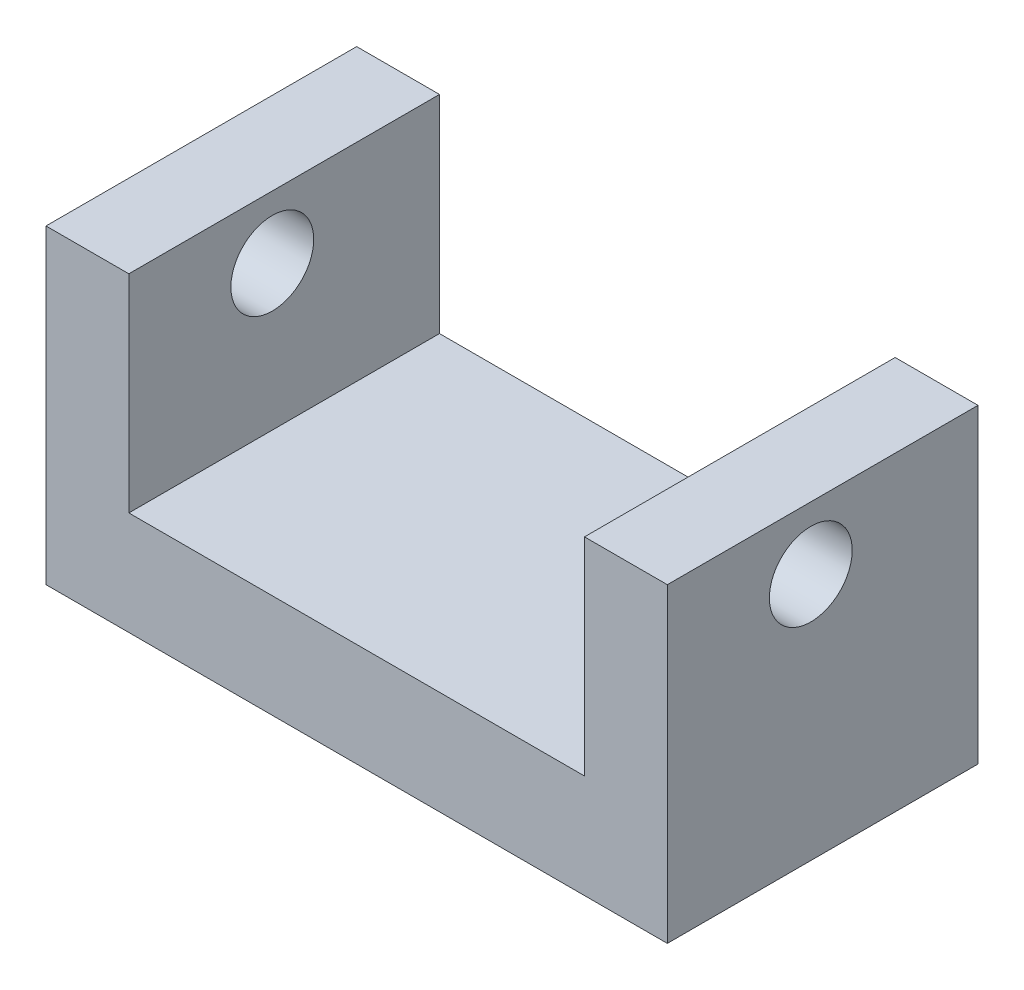
ISO-10303-21;
HEADER;
FILE_DESCRIPTION(('STEP AP214'),'2;1');
FILE_NAME('part.step','',(''),(''),'','','');
FILE_SCHEMA(('AUTOMOTIVE_DESIGN { 1 0 10303 214 1 1 1 1 }'));
ENDSEC;
DATA;
#1=APPLICATION_CONTEXT('core data for automotive mechanical design processes');
#2=APPLICATION_PROTOCOL_DEFINITION('international standard','automotive_design',2000,#1);
#3=PRODUCT_CONTEXT('',#1,'mechanical');
#4=PRODUCT('Part','Part','',(#3));
#5=PRODUCT_RELATED_PRODUCT_CATEGORY('part','',(#4));
#6=PRODUCT_DEFINITION_FORMATION('','',#4);
#7=PRODUCT_DEFINITION_CONTEXT('part definition',#1,'design');
#8=PRODUCT_DEFINITION('design','',#6,#7);
#9=PRODUCT_DEFINITION_SHAPE('','',#8);
#10=(LENGTH_UNIT() NAMED_UNIT(*) SI_UNIT(.MILLI.,.METRE.));
#11=(NAMED_UNIT(*) PLANE_ANGLE_UNIT() SI_UNIT($,.RADIAN.));
#12=(NAMED_UNIT(*) SI_UNIT($,.STERADIAN.) SOLID_ANGLE_UNIT());
#13=UNCERTAINTY_MEASURE_WITH_UNIT(LENGTH_MEASURE(1.E-05),#10,'distance_accuracy_value','');
#14=(GEOMETRIC_REPRESENTATION_CONTEXT(3) GLOBAL_UNCERTAINTY_ASSIGNED_CONTEXT((#13)) GLOBAL_UNIT_ASSIGNED_CONTEXT((#10,
#11,#12)) REPRESENTATION_CONTEXT('',''));
#15=CARTESIAN_POINT('',(0.,0.,0.));
#16=DIRECTION('',(0.,0.,1.));
#17=DIRECTION('',(1.,0.,0.));
#18=AXIS2_PLACEMENT_3D('',#15,#16,#17);
#19=CARTESIAN_POINT('',(150.,0.,75.));
#20=DIRECTION('',(0.,1.,0.));
#21=DIRECTION('',(-1.,0.,0.));
#22=AXIS2_PLACEMENT_3D('',#19,#20,#21);
#23=PLANE('',#22);
#24=DIRECTION('',(1.,0.,0.));
#25=VECTOR('',#24,1.);
#26=CARTESIAN_POINT('',(150.,0.,0.));
#27=LINE('',#26,#25);
#28=CARTESIAN_POINT('',(0.,0.,0.));
#29=VERTEX_POINT('',#28);
#30=CARTESIAN_POINT('',(150.,0.,0.));
#31=VERTEX_POINT('',#30);
#32=EDGE_CURVE('E131',#29,#31,#27,.T.);
#33=ORIENTED_EDGE('',*,*,#32,.T.);
#34=DIRECTION('',(0.,0.,-1.));
#35=VECTOR('',#34,1.);
#36=CARTESIAN_POINT('',(150.,0.,75.));
#37=LINE('',#36,#35);
#38=CARTESIAN_POINT('',(150.,0.,75.));
#39=VERTEX_POINT('',#38);
#40=EDGE_CURVE('E11',#39,#31,#37,.T.);
#41=ORIENTED_EDGE('',*,*,#40,.F.);
#42=DIRECTION('',(1.,0.,0.));
#43=VECTOR('',#42,1.);
#44=CARTESIAN_POINT('',(150.,0.,75.));
#45=LINE('',#44,#43);
#46=CARTESIAN_POINT('',(0.,0.,75.));
#47=VERTEX_POINT('',#46);
#48=EDGE_CURVE('E146',#47,#39,#45,.T.);
#49=ORIENTED_EDGE('',*,*,#48,.F.);
#50=DIRECTION('',(0.,0.,-1.));
#51=VECTOR('',#50,1.);
#52=CARTESIAN_POINT('',(0.,0.,75.));
#53=LINE('',#52,#51);
#54=EDGE_CURVE('E127',#47,#29,#53,.T.);
#55=ORIENTED_EDGE('',*,*,#54,.T.);
#56=EDGE_LOOP('',(#33,#41,#49,#55));
#57=FACE_BOUND('',#56,.T.);
#58=ADVANCED_FACE('F35',(#57),#23,.F.);
#59=CARTESIAN_POINT('',(150.,75.,75.));
#60=DIRECTION('',(-1.,0.,0.));
#61=DIRECTION('',(0.,-1.,0.));
#62=AXIS2_PLACEMENT_3D('',#59,#60,#61);
#63=PLANE('',#62);
#64=CARTESIAN_POINT('',(150.,59.8871368392509,40.3687254442389));
#65=DIRECTION('',(1.,0.,0.));
#66=DIRECTION('',(0.,1.,0.));
#67=AXIS2_PLACEMENT_3D('',#64,#65,#66);
#68=CIRCLE('',#67,10.);
#69=CARTESIAN_POINT('',(150.,69.8871368392509,40.3687254442389));
#70=VERTEX_POINT('',#69);
#71=EDGE_CURVE('E185',#70,#70,#68,.T.);
#72=ORIENTED_EDGE('',*,*,#71,.F.);
#73=EDGE_LOOP('',(#72));
#74=FACE_BOUND('',#73,.T.);
#75=DIRECTION('',(0.,1.,0.));
#76=VECTOR('',#75,1.);
#77=CARTESIAN_POINT('',(150.,75.,0.));
#78=LINE('',#77,#76);
#79=CARTESIAN_POINT('',(150.,75.,0.));
#80=VERTEX_POINT('',#79);
#81=EDGE_CURVE('E134',#31,#80,#78,.T.);
#82=ORIENTED_EDGE('',*,*,#81,.T.);
#83=DIRECTION('',(0.,0.,-1.));
#84=VECTOR('',#83,1.);
#85=CARTESIAN_POINT('',(150.,75.,75.));
#86=LINE('',#85,#84);
#87=CARTESIAN_POINT('',(150.,75.,75.));
#88=VERTEX_POINT('',#87);
#89=EDGE_CURVE('E43',#88,#80,#86,.T.);
#90=ORIENTED_EDGE('',*,*,#89,.F.);
#91=DIRECTION('',(0.,1.,0.));
#92=VECTOR('',#91,1.);
#93=CARTESIAN_POINT('',(150.,75.,75.));
#94=LINE('',#93,#92);
#95=EDGE_CURVE('E94',#39,#88,#94,.T.);
#96=ORIENTED_EDGE('',*,*,#95,.F.);
#97=ORIENTED_EDGE('',*,*,#40,.T.);
#98=EDGE_LOOP('',(#82,#90,#96,#97));
#99=FACE_BOUND('',#98,.T.);
#100=ADVANCED_FACE('F209',(#74,#99),#63,.F.);
#101=CARTESIAN_POINT('',(130.,75.,75.));
#102=DIRECTION('',(0.,-1.,0.));
#103=DIRECTION('',(1.,0.,0.));
#104=AXIS2_PLACEMENT_3D('',#101,#102,#103);
#105=PLANE('',#104);
#106=DIRECTION('',(-1.,0.,0.));
#107=VECTOR('',#106,1.);
#108=CARTESIAN_POINT('',(130.,75.,0.));
#109=LINE('',#108,#107);
#110=CARTESIAN_POINT('',(130.,75.,0.));
#111=VERTEX_POINT('',#110);
#112=EDGE_CURVE('E137',#80,#111,#109,.T.);
#113=ORIENTED_EDGE('',*,*,#112,.T.);
#114=DIRECTION('',(0.,0.,-1.));
#115=VECTOR('',#114,1.);
#116=CARTESIAN_POINT('',(130.,75.,75.));
#117=LINE('',#116,#115);
#118=CARTESIAN_POINT('',(130.,75.,75.));
#119=VERTEX_POINT('',#118);
#120=EDGE_CURVE('E153',#119,#111,#117,.T.);
#121=ORIENTED_EDGE('',*,*,#120,.F.);
#122=DIRECTION('',(-1.,0.,0.));
#123=VECTOR('',#122,1.);
#124=CARTESIAN_POINT('',(130.,75.,75.));
#125=LINE('',#124,#123);
#126=EDGE_CURVE('E161',#88,#119,#125,.T.);
#127=ORIENTED_EDGE('',*,*,#126,.F.);
#128=ORIENTED_EDGE('',*,*,#89,.T.);
#129=EDGE_LOOP('',(#113,#121,#127,#128));
#130=FACE_BOUND('',#129,.T.);
#131=ADVANCED_FACE('F159',(#130),#105,.F.);
#132=CARTESIAN_POINT('',(130.,25.,75.));
#133=DIRECTION('',(1.,0.,0.));
#134=DIRECTION('',(0.,0.,-1.));
#135=AXIS2_PLACEMENT_3D('',#132,#133,#134);
#136=PLANE('',#135);
#137=CARTESIAN_POINT('',(130.,59.8871368392509,40.3687254442389));
#138=DIRECTION('',(1.,0.,0.));
#139=DIRECTION('',(0.,0.,-1.));
#140=AXIS2_PLACEMENT_3D('',#137,#138,#139);
#141=CIRCLE('',#140,10.);
#142=CARTESIAN_POINT('',(130.,59.8871368392509,30.3687254442389));
#143=VERTEX_POINT('',#142);
#144=EDGE_CURVE('E135',#143,#143,#141,.T.);
#145=ORIENTED_EDGE('',*,*,#144,.T.);
#146=EDGE_LOOP('',(#145));
#147=FACE_BOUND('',#146,.T.);
#148=DIRECTION('',(0.,-1.,0.));
#149=VECTOR('',#148,1.);
#150=CARTESIAN_POINT('',(130.,25.,0.));
#151=LINE('',#150,#149);
#152=CARTESIAN_POINT('',(130.,25.,0.));
#153=VERTEX_POINT('',#152);
#154=EDGE_CURVE('E139',#111,#153,#151,.T.);
#155=ORIENTED_EDGE('',*,*,#154,.T.);
#156=DIRECTION('',(0.,0.,-1.));
#157=VECTOR('',#156,1.);
#158=CARTESIAN_POINT('',(130.,25.,75.));
#159=LINE('',#158,#157);
#160=CARTESIAN_POINT('',(130.,25.,75.));
#161=VERTEX_POINT('',#160);
#162=EDGE_CURVE('E150',#161,#153,#159,.T.);
#163=ORIENTED_EDGE('',*,*,#162,.F.);
#164=DIRECTION('',(0.,-1.,0.));
#165=VECTOR('',#164,1.);
#166=CARTESIAN_POINT('',(130.,25.,75.));
#167=LINE('',#166,#165);
#168=EDGE_CURVE('E173',#119,#161,#167,.T.);
#169=ORIENTED_EDGE('',*,*,#168,.F.);
#170=ORIENTED_EDGE('',*,*,#120,.T.);
#171=EDGE_LOOP('',(#155,#163,#169,#170));
#172=FACE_BOUND('',#171,.T.);
#173=ADVANCED_FACE('F169',(#147,#172),#136,.F.);
#174=CARTESIAN_POINT('',(20.,25.,75.));
#175=DIRECTION('',(0.,-1.,0.));
#176=DIRECTION('',(0.,0.,-1.));
#177=AXIS2_PLACEMENT_3D('',#174,#175,#176);
#178=PLANE('',#177);
#179=DIRECTION('',(-1.,0.,0.));
#180=VECTOR('',#179,1.);
#181=CARTESIAN_POINT('',(20.,25.,0.));
#182=LINE('',#181,#180);
#183=CARTESIAN_POINT('',(20.,25.,0.));
#184=VERTEX_POINT('',#183);
#185=EDGE_CURVE('E141',#153,#184,#182,.T.);
#186=ORIENTED_EDGE('',*,*,#185,.T.);
#187=DIRECTION('',(0.,0.,-1.));
#188=VECTOR('',#187,1.);
#189=CARTESIAN_POINT('',(20.,25.,75.));
#190=LINE('',#189,#188);
#191=CARTESIAN_POINT('',(20.,25.,75.));
#192=VERTEX_POINT('',#191);
#193=EDGE_CURVE('E122',#192,#184,#190,.T.);
#194=ORIENTED_EDGE('',*,*,#193,.F.);
#195=DIRECTION('',(-1.,0.,0.));
#196=VECTOR('',#195,1.);
#197=CARTESIAN_POINT('',(20.,25.,75.));
#198=LINE('',#197,#196);
#199=EDGE_CURVE('E113',#161,#192,#198,.T.);
#200=ORIENTED_EDGE('',*,*,#199,.F.);
#201=ORIENTED_EDGE('',*,*,#162,.T.);
#202=EDGE_LOOP('',(#186,#194,#200,#201));
#203=FACE_BOUND('',#202,.T.);
#204=ADVANCED_FACE('F172',(#203),#178,.F.);
#205=CARTESIAN_POINT('',(20.,75.,75.));
#206=DIRECTION('',(-1.,0.,0.));
#207=DIRECTION('',(0.,-1.,0.));
#208=AXIS2_PLACEMENT_3D('',#205,#206,#207);
#209=PLANE('',#208);
#210=CARTESIAN_POINT('',(20.,59.8871368392509,40.3687254442389));
#211=DIRECTION('',(-1.,0.,0.));
#212=DIRECTION('',(0.,-1.,0.));
#213=AXIS2_PLACEMENT_3D('',#210,#211,#212);
#214=CIRCLE('',#213,10.);
#215=CARTESIAN_POINT('',(20.,49.8871368392509,40.3687254442389));
#216=VERTEX_POINT('',#215);
#217=EDGE_CURVE('E181',#216,#216,#214,.T.);
#218=ORIENTED_EDGE('',*,*,#217,.T.);
#219=EDGE_LOOP('',(#218));
#220=FACE_BOUND('',#219,.T.);
#221=DIRECTION('',(0.,1.,0.));
#222=VECTOR('',#221,1.);
#223=CARTESIAN_POINT('',(20.,75.,0.));
#224=LINE('',#223,#222);
#225=CARTESIAN_POINT('',(20.,75.,0.));
#226=VERTEX_POINT('',#225);
#227=EDGE_CURVE('E121',#184,#226,#224,.T.);
#228=ORIENTED_EDGE('',*,*,#227,.T.);
#229=DIRECTION('',(0.,0.,-1.));
#230=VECTOR('',#229,1.);
#231=CARTESIAN_POINT('',(20.,75.,75.));
#232=LINE('',#231,#230);
#233=CARTESIAN_POINT('',(20.,75.,75.));
#234=VERTEX_POINT('',#233);
#235=EDGE_CURVE('E118',#234,#226,#232,.T.);
#236=ORIENTED_EDGE('',*,*,#235,.F.);
#237=DIRECTION('',(0.,1.,0.));
#238=VECTOR('',#237,1.);
#239=CARTESIAN_POINT('',(20.,75.,75.));
#240=LINE('',#239,#238);
#241=EDGE_CURVE('E107',#192,#234,#240,.T.);
#242=ORIENTED_EDGE('',*,*,#241,.F.);
#243=ORIENTED_EDGE('',*,*,#193,.T.);
#244=EDGE_LOOP('',(#228,#236,#242,#243));
#245=FACE_BOUND('',#244,.T.);
#246=ADVANCED_FACE('F119',(#220,#245),#209,.F.);
#247=CARTESIAN_POINT('',(0.,75.,75.));
#248=DIRECTION('',(0.,-1.,0.));
#249=DIRECTION('',(0.,0.,-1.));
#250=AXIS2_PLACEMENT_3D('',#247,#248,#249);
#251=PLANE('',#250);
#252=DIRECTION('',(-1.,0.,0.));
#253=VECTOR('',#252,1.);
#254=CARTESIAN_POINT('',(0.,75.,0.));
#255=LINE('',#254,#253);
#256=CARTESIAN_POINT('',(0.,75.,0.));
#257=VERTEX_POINT('',#256);
#258=EDGE_CURVE('E80',#226,#257,#255,.T.);
#259=ORIENTED_EDGE('',*,*,#258,.T.);
#260=DIRECTION('',(0.,0.,-1.));
#261=VECTOR('',#260,1.);
#262=CARTESIAN_POINT('',(0.,75.,75.));
#263=LINE('',#262,#261);
#264=CARTESIAN_POINT('',(0.,75.,75.));
#265=VERTEX_POINT('',#264);
#266=EDGE_CURVE('E123',#265,#257,#263,.T.);
#267=ORIENTED_EDGE('',*,*,#266,.F.);
#268=DIRECTION('',(-1.,0.,0.));
#269=VECTOR('',#268,1.);
#270=CARTESIAN_POINT('',(0.,75.,75.));
#271=LINE('',#270,#269);
#272=EDGE_CURVE('E111',#234,#265,#271,.T.);
#273=ORIENTED_EDGE('',*,*,#272,.F.);
#274=ORIENTED_EDGE('',*,*,#235,.T.);
#275=EDGE_LOOP('',(#259,#267,#273,#274));
#276=FACE_BOUND('',#275,.T.);
#277=ADVANCED_FACE('F125',(#276),#251,.F.);
#278=CARTESIAN_POINT('',(0.,0.,75.));
#279=DIRECTION('',(1.,0.,0.));
#280=DIRECTION('',(0.,0.,-1.));
#281=AXIS2_PLACEMENT_3D('',#278,#279,#280);
#282=PLANE('',#281);
#283=CARTESIAN_POINT('',(0.,59.8871368392509,40.3687254442389));
#284=DIRECTION('',(1.,0.,0.));
#285=DIRECTION('',(0.,1.,0.));
#286=AXIS2_PLACEMENT_3D('',#283,#284,#285);
#287=CIRCLE('',#286,10.);
#288=CARTESIAN_POINT('',(0.,69.8871368392509,40.3687254442389));
#289=VERTEX_POINT('',#288);
#290=EDGE_CURVE('E184',#289,#289,#287,.T.);
#291=ORIENTED_EDGE('',*,*,#290,.T.);
#292=EDGE_LOOP('',(#291));
#293=FACE_BOUND('',#292,.T.);
#294=DIRECTION('',(0.,-1.,0.));
#295=VECTOR('',#294,1.);
#296=CARTESIAN_POINT('',(0.,0.,0.));
#297=LINE('',#296,#295);
#298=EDGE_CURVE('E86',#257,#29,#297,.T.);
#299=ORIENTED_EDGE('',*,*,#298,.T.);
#300=ORIENTED_EDGE('',*,*,#54,.F.);
#301=DIRECTION('',(0.,-1.,0.));
#302=VECTOR('',#301,1.);
#303=CARTESIAN_POINT('',(0.,0.,75.));
#304=LINE('',#303,#302);
#305=EDGE_CURVE('E51',#265,#47,#304,.T.);
#306=ORIENTED_EDGE('',*,*,#305,.F.);
#307=ORIENTED_EDGE('',*,*,#266,.T.);
#308=EDGE_LOOP('',(#299,#300,#306,#307));
#309=FACE_BOUND('',#308,.T.);
#310=ADVANCED_FACE('F191',(#293,#309),#282,.F.);
#311=CARTESIAN_POINT('',(0.,0.,75.));
#312=DIRECTION('',(0.,0.,-1.));
#313=DIRECTION('',(-1.,0.,0.));
#314=AXIS2_PLACEMENT_3D('',#311,#312,#313);
#315=PLANE('',#314);
#316=ORIENTED_EDGE('',*,*,#48,.T.);
#317=ORIENTED_EDGE('',*,*,#95,.T.);
#318=ORIENTED_EDGE('',*,*,#126,.T.);
#319=ORIENTED_EDGE('',*,*,#168,.T.);
#320=ORIENTED_EDGE('',*,*,#199,.T.);
#321=ORIENTED_EDGE('',*,*,#241,.T.);
#322=ORIENTED_EDGE('',*,*,#272,.T.);
#323=ORIENTED_EDGE('',*,*,#305,.T.);
#324=EDGE_LOOP('',(#316,#317,#318,#319,#320,#321,#322,#323));
#325=FACE_BOUND('',#324,.T.);
#326=ADVANCED_FACE('F109',(#325),#315,.F.);
#327=CARTESIAN_POINT('',(0.,0.,0.));
#328=DIRECTION('',(0.,0.,-1.));
#329=DIRECTION('',(-1.,0.,0.));
#330=AXIS2_PLACEMENT_3D('',#327,#328,#329);
#331=PLANE('',#330);
#332=ORIENTED_EDGE('',*,*,#32,.F.);
#333=ORIENTED_EDGE('',*,*,#298,.F.);
#334=ORIENTED_EDGE('',*,*,#258,.F.);
#335=ORIENTED_EDGE('',*,*,#227,.F.);
#336=ORIENTED_EDGE('',*,*,#185,.F.);
#337=ORIENTED_EDGE('',*,*,#154,.F.);
#338=ORIENTED_EDGE('',*,*,#112,.F.);
#339=ORIENTED_EDGE('',*,*,#81,.F.);
#340=EDGE_LOOP('',(#332,#333,#334,#335,#336,#337,#338,#339));
#341=FACE_BOUND('',#340,.T.);
#342=ADVANCED_FACE('F165',(#341),#331,.T.);
#343=CARTESIAN_POINT('',(0.,59.8871368392509,40.3687254442389));
#344=DIRECTION('',(1.,0.,0.));
#345=DIRECTION('',(0.,1.,0.));
#346=AXIS2_PLACEMENT_3D('',#343,#344,#345);
#347=CYLINDRICAL_SURFACE('',#346,10.);
#348=ORIENTED_EDGE('',*,*,#290,.F.);
#349=EDGE_LOOP('',(#348));
#350=FACE_BOUND('',#349,.T.);
#351=ORIENTED_EDGE('',*,*,#217,.F.);
#352=EDGE_LOOP('',(#351));
#353=FACE_BOUND('',#352,.T.);
#354=ADVANCED_FACE('F193',(#350,#353),#347,.F.);
#355=ORIENTED_EDGE('',*,*,#71,.T.);
#356=EDGE_LOOP('',(#355));
#357=FACE_BOUND('',#356,.T.);
#358=ORIENTED_EDGE('',*,*,#144,.F.);
#359=EDGE_LOOP('',(#358));
#360=FACE_BOUND('',#359,.T.);
#361=ADVANCED_FACE('F196',(#357,#360),#347,.F.);
#362=CLOSED_SHELL('',(#58,#100,#131,#173,#204,#246,#277,#310,#326,#342,#354,#361));
#363=MANIFOLD_SOLID_BREP('B2',#362);
#364=ADVANCED_BREP_SHAPE_REPRESENTATION('',(#18,#363),#14);
#365=SHAPE_DEFINITION_REPRESENTATION(#9,#364);
ENDSEC;
END-ISO-10303-21;
